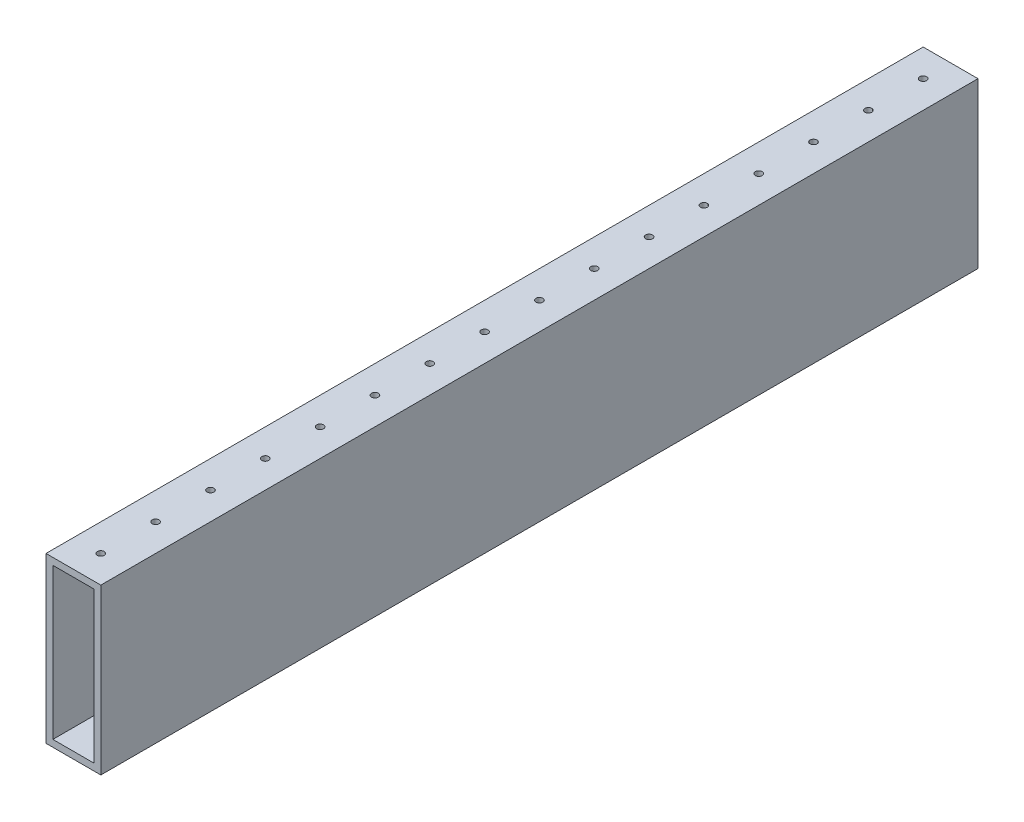
ISO-10303-21;
HEADER;
FILE_DESCRIPTION(('STEP AP214'),'2;1');
FILE_NAME('part.step','',(''),(''),'','','');
FILE_SCHEMA(('AUTOMOTIVE_DESIGN { 1 0 10303 214 1 1 1 1 }'));
ENDSEC;
DATA;
#1=APPLICATION_CONTEXT('core data for automotive mechanical design processes');
#2=APPLICATION_PROTOCOL_DEFINITION('international standard','automotive_design',2000,#1);
#3=PRODUCT_CONTEXT('',#1,'mechanical');
#4=PRODUCT('Part','Part','',(#3));
#5=PRODUCT_RELATED_PRODUCT_CATEGORY('part','',(#4));
#6=PRODUCT_DEFINITION_FORMATION('','',#4);
#7=PRODUCT_DEFINITION_CONTEXT('part definition',#1,'design');
#8=PRODUCT_DEFINITION('design','',#6,#7);
#9=PRODUCT_DEFINITION_SHAPE('','',#8);
#10=(LENGTH_UNIT() NAMED_UNIT(*) SI_UNIT(.MILLI.,.METRE.));
#11=(NAMED_UNIT(*) PLANE_ANGLE_UNIT() SI_UNIT($,.RADIAN.));
#12=(NAMED_UNIT(*) SI_UNIT($,.STERADIAN.) SOLID_ANGLE_UNIT());
#13=UNCERTAINTY_MEASURE_WITH_UNIT(LENGTH_MEASURE(1.E-05),#10,'distance_accuracy_value','');
#14=(GEOMETRIC_REPRESENTATION_CONTEXT(3) GLOBAL_UNCERTAINTY_ASSIGNED_CONTEXT((#13)) GLOBAL_UNIT_ASSIGNED_CONTEXT((#10,
#11,#12)) REPRESENTATION_CONTEXT('',''));
#15=CARTESIAN_POINT('',(0.,0.,0.));
#16=DIRECTION('',(0.,0.,1.));
#17=DIRECTION('',(1.,0.,0.));
#18=AXIS2_PLACEMENT_3D('',#15,#16,#17);
#19=CARTESIAN_POINT('',(0.,0.,406.4));
#20=DIRECTION('',(0.,0.,-1.));
#21=DIRECTION('',(-1.,0.,0.));
#22=AXIS2_PLACEMENT_3D('',#19,#20,#21);
#23=PLANE('',#22);
#24=DIRECTION('',(0.,1.,0.));
#25=VECTOR('',#24,1.);
#26=CARTESIAN_POINT('',(12.7,-38.1,406.4));
#27=LINE('',#26,#25);
#28=CARTESIAN_POINT('',(12.7,-38.1,406.4));
#29=VERTEX_POINT('',#28);
#30=CARTESIAN_POINT('',(12.7,38.1,406.4));
#31=VERTEX_POINT('',#30);
#32=EDGE_CURVE('E131',#29,#31,#27,.T.);
#33=ORIENTED_EDGE('',*,*,#32,.T.);
#34=DIRECTION('',(-1.,0.,0.));
#35=VECTOR('',#34,1.);
#36=CARTESIAN_POINT('',(-12.7,38.1,406.4));
#37=LINE('',#36,#35);
#38=CARTESIAN_POINT('',(-12.7,38.1,406.4));
#39=VERTEX_POINT('',#38);
#40=EDGE_CURVE('E134',#31,#39,#37,.T.);
#41=ORIENTED_EDGE('',*,*,#40,.T.);
#42=DIRECTION('',(0.,-1.,0.));
#43=VECTOR('',#42,1.);
#44=CARTESIAN_POINT('',(-12.7,-38.1,406.4));
#45=LINE('',#44,#43);
#46=CARTESIAN_POINT('',(-12.7,-38.1,406.4));
#47=VERTEX_POINT('',#46);
#48=EDGE_CURVE('E137',#39,#47,#45,.T.);
#49=ORIENTED_EDGE('',*,*,#48,.T.);
#50=DIRECTION('',(1.,0.,0.));
#51=VECTOR('',#50,1.);
#52=CARTESIAN_POINT('',(-12.7,-38.1,406.4));
#53=LINE('',#52,#51);
#54=EDGE_CURVE('E139',#47,#29,#53,.T.);
#55=ORIENTED_EDGE('',*,*,#54,.T.);
#56=EDGE_LOOP('',(#33,#41,#49,#55));
#57=FACE_BOUND('',#56,.T.);
#58=DIRECTION('',(0.,1.,0.));
#59=VECTOR('',#58,1.);
#60=CARTESIAN_POINT('',(9.525,0.,406.4));
#61=LINE('',#60,#59);
#62=CARTESIAN_POINT('',(9.525,-34.925,406.4));
#63=VERTEX_POINT('',#62);
#64=CARTESIAN_POINT('',(9.525,34.925,406.4));
#65=VERTEX_POINT('',#64);
#66=EDGE_CURVE('E119',#63,#65,#61,.T.);
#67=ORIENTED_EDGE('',*,*,#66,.F.);
#68=DIRECTION('',(1.,0.,0.));
#69=VECTOR('',#68,1.);
#70=CARTESIAN_POINT('',(0.,-34.925,406.4));
#71=LINE('',#70,#69);
#72=CARTESIAN_POINT('',(-9.525,-34.925,406.4));
#73=VERTEX_POINT('',#72);
#74=EDGE_CURVE('E103',#73,#63,#71,.T.);
#75=ORIENTED_EDGE('',*,*,#74,.F.);
#76=DIRECTION('',(0.,-1.,0.));
#77=VECTOR('',#76,1.);
#78=CARTESIAN_POINT('',(-9.525,0.,406.4));
#79=LINE('',#78,#77);
#80=CARTESIAN_POINT('',(-9.525,34.925,406.4));
#81=VERTEX_POINT('',#80);
#82=EDGE_CURVE('E128',#81,#73,#79,.T.);
#83=ORIENTED_EDGE('',*,*,#82,.F.);
#84=DIRECTION('',(-1.,0.,0.));
#85=VECTOR('',#84,1.);
#86=CARTESIAN_POINT('',(0.,34.925,406.4));
#87=LINE('',#86,#85);
#88=EDGE_CURVE('E121',#65,#81,#87,.T.);
#89=ORIENTED_EDGE('',*,*,#88,.F.);
#90=EDGE_LOOP('',(#67,#75,#83,#89));
#91=FACE_BOUND('',#90,.T.);
#92=ADVANCED_FACE('F33',(#57,#91),#23,.F.);
#93=CARTESIAN_POINT('',(0.,0.,0.));
#94=DIRECTION('',(0.,0.,-1.));
#95=DIRECTION('',(-1.,0.,0.));
#96=AXIS2_PLACEMENT_3D('',#93,#94,#95);
#97=PLANE('',#96);
#98=DIRECTION('',(0.,1.,0.));
#99=VECTOR('',#98,1.);
#100=CARTESIAN_POINT('',(12.7,-38.1,0.));
#101=LINE('',#100,#99);
#102=CARTESIAN_POINT('',(12.7,-38.1,0.));
#103=VERTEX_POINT('',#102);
#104=CARTESIAN_POINT('',(12.7,38.1,0.));
#105=VERTEX_POINT('',#104);
#106=EDGE_CURVE('E142',#103,#105,#101,.T.);
#107=ORIENTED_EDGE('',*,*,#106,.F.);
#108=DIRECTION('',(1.,0.,0.));
#109=VECTOR('',#108,1.);
#110=CARTESIAN_POINT('',(-12.7,-38.1,0.));
#111=LINE('',#110,#109);
#112=CARTESIAN_POINT('',(-12.7,-38.1,0.));
#113=VERTEX_POINT('',#112);
#114=EDGE_CURVE('E135',#113,#103,#111,.T.);
#115=ORIENTED_EDGE('',*,*,#114,.F.);
#116=DIRECTION('',(0.,-1.,0.));
#117=VECTOR('',#116,1.);
#118=CARTESIAN_POINT('',(-12.7,-38.1,0.));
#119=LINE('',#118,#117);
#120=CARTESIAN_POINT('',(-12.7,38.1,0.));
#121=VERTEX_POINT('',#120);
#122=EDGE_CURVE('E147',#121,#113,#119,.T.);
#123=ORIENTED_EDGE('',*,*,#122,.F.);
#124=DIRECTION('',(-1.,0.,0.));
#125=VECTOR('',#124,1.);
#126=CARTESIAN_POINT('',(-12.7,38.1,0.));
#127=LINE('',#126,#125);
#128=EDGE_CURVE('E145',#105,#121,#127,.T.);
#129=ORIENTED_EDGE('',*,*,#128,.F.);
#130=EDGE_LOOP('',(#107,#115,#123,#129));
#131=FACE_BOUND('',#130,.T.);
#132=DIRECTION('',(1.,0.,0.));
#133=VECTOR('',#132,1.);
#134=CARTESIAN_POINT('',(0.,-34.925,0.));
#135=LINE('',#134,#133);
#136=CARTESIAN_POINT('',(-9.525,-34.925,0.));
#137=VERTEX_POINT('',#136);
#138=CARTESIAN_POINT('',(9.525,-34.925,0.));
#139=VERTEX_POINT('',#138);
#140=EDGE_CURVE('E101',#137,#139,#135,.T.);
#141=ORIENTED_EDGE('',*,*,#140,.T.);
#142=DIRECTION('',(0.,1.,0.));
#143=VECTOR('',#142,1.);
#144=CARTESIAN_POINT('',(9.525,0.,0.));
#145=LINE('',#144,#143);
#146=CARTESIAN_POINT('',(9.525,34.925,0.));
#147=VERTEX_POINT('',#146);
#148=EDGE_CURVE('E109',#139,#147,#145,.T.);
#149=ORIENTED_EDGE('',*,*,#148,.T.);
#150=DIRECTION('',(-1.,0.,0.));
#151=VECTOR('',#150,1.);
#152=CARTESIAN_POINT('',(0.,34.925,0.));
#153=LINE('',#152,#151);
#154=CARTESIAN_POINT('',(-9.525,34.925,0.));
#155=VERTEX_POINT('',#154);
#156=EDGE_CURVE('E115',#147,#155,#153,.T.);
#157=ORIENTED_EDGE('',*,*,#156,.T.);
#158=DIRECTION('',(0.,-1.,0.));
#159=VECTOR('',#158,1.);
#160=CARTESIAN_POINT('',(-9.525,0.,0.));
#161=LINE('',#160,#159);
#162=EDGE_CURVE('E55',#155,#137,#161,.T.);
#163=ORIENTED_EDGE('',*,*,#162,.T.);
#164=EDGE_LOOP('',(#141,#149,#157,#163));
#165=FACE_BOUND('',#164,.T.);
#166=ADVANCED_FACE('F118',(#131,#165),#97,.T.);
#167=CARTESIAN_POINT('',(12.7,-38.1,406.4));
#168=DIRECTION('',(-1.,0.,0.));
#169=DIRECTION('',(0.,0.,1.));
#170=AXIS2_PLACEMENT_3D('',#167,#168,#169);
#171=PLANE('',#170);
#172=ORIENTED_EDGE('',*,*,#106,.T.);
#173=DIRECTION('',(0.,0.,-1.));
#174=VECTOR('',#173,1.);
#175=CARTESIAN_POINT('',(12.7,38.1,406.4));
#176=LINE('',#175,#174);
#177=EDGE_CURVE('E158',#31,#105,#176,.T.);
#178=ORIENTED_EDGE('',*,*,#177,.F.);
#179=ORIENTED_EDGE('',*,*,#32,.F.);
#180=DIRECTION('',(0.,0.,-1.));
#181=VECTOR('',#180,1.);
#182=CARTESIAN_POINT('',(12.7,-38.1,406.4));
#183=LINE('',#182,#181);
#184=EDGE_CURVE('E141',#29,#103,#183,.T.);
#185=ORIENTED_EDGE('',*,*,#184,.T.);
#186=EDGE_LOOP('',(#172,#178,#179,#185));
#187=FACE_BOUND('',#186,.T.);
#188=ADVANCED_FACE('F251',(#187),#171,.F.);
#189=CARTESIAN_POINT('',(-12.7,38.1,406.4));
#190=DIRECTION('',(0.,-1.,0.));
#191=DIRECTION('',(0.,0.,-1.));
#192=AXIS2_PLACEMENT_3D('',#189,#190,#191);
#193=PLANE('',#192);
#194=CARTESIAN_POINT('',(0.,38.1,38.1));
#195=DIRECTION('',(0.,1.,0.));
#196=DIRECTION('',(0.,0.,1.));
#197=AXIS2_PLACEMENT_3D('',#194,#195,#196);
#198=CIRCLE('',#197,1.5875);
#199=CARTESIAN_POINT('',(0.,38.1,39.6875));
#200=VERTEX_POINT('',#199);
#201=EDGE_CURVE('E439',#200,#200,#198,.T.);
#202=ORIENTED_EDGE('',*,*,#201,.F.);
#203=EDGE_LOOP('',(#202));
#204=FACE_BOUND('',#203,.T.);
#205=CARTESIAN_POINT('',(0.,38.1,12.7));
#206=DIRECTION('',(0.,1.,0.));
#207=DIRECTION('',(0.,0.,1.));
#208=AXIS2_PLACEMENT_3D('',#205,#206,#207);
#209=CIRCLE('',#208,1.5875);
#210=CARTESIAN_POINT('',(0.,38.1,14.2875));
#211=VERTEX_POINT('',#210);
#212=EDGE_CURVE('E438',#211,#211,#209,.T.);
#213=ORIENTED_EDGE('',*,*,#212,.F.);
#214=EDGE_LOOP('',(#213));
#215=FACE_BOUND('',#214,.T.);
#216=ORIENTED_EDGE('',*,*,#128,.T.);
#217=DIRECTION('',(0.,0.,-1.));
#218=VECTOR('',#217,1.);
#219=CARTESIAN_POINT('',(-12.7,38.1,406.4));
#220=LINE('',#219,#218);
#221=EDGE_CURVE('E155',#39,#121,#220,.T.);
#222=ORIENTED_EDGE('',*,*,#221,.F.);
#223=ORIENTED_EDGE('',*,*,#40,.F.);
#224=ORIENTED_EDGE('',*,*,#177,.T.);
#225=EDGE_LOOP('',(#216,#222,#223,#224));
#226=FACE_BOUND('',#225,.T.);
#227=CARTESIAN_POINT('',(0.,38.1,63.5));
#228=DIRECTION('',(0.,1.,0.));
#229=DIRECTION('',(0.,0.,1.));
#230=AXIS2_PLACEMENT_3D('',#227,#228,#229);
#231=CIRCLE('',#230,1.5875);
#232=CARTESIAN_POINT('',(0.,38.1,65.0875));
#233=VERTEX_POINT('',#232);
#234=EDGE_CURVE('E164',#233,#233,#231,.T.);
#235=ORIENTED_EDGE('',*,*,#234,.F.);
#236=EDGE_LOOP('',(#235));
#237=FACE_BOUND('',#236,.T.);
#238=CARTESIAN_POINT('',(0.,38.1,88.9));
#239=DIRECTION('',(0.,1.,0.));
#240=DIRECTION('',(0.,0.,1.));
#241=AXIS2_PLACEMENT_3D('',#238,#239,#240);
#242=CIRCLE('',#241,1.5875);
#243=CARTESIAN_POINT('',(0.,38.1,90.4875));
#244=VERTEX_POINT('',#243);
#245=EDGE_CURVE('E170',#244,#244,#242,.T.);
#246=ORIENTED_EDGE('',*,*,#245,.F.);
#247=EDGE_LOOP('',(#246));
#248=FACE_BOUND('',#247,.T.);
#249=CARTESIAN_POINT('',(0.,38.1,114.3));
#250=DIRECTION('',(0.,1.,0.));
#251=DIRECTION('',(0.,0.,1.));
#252=AXIS2_PLACEMENT_3D('',#249,#250,#251);
#253=CIRCLE('',#252,1.5875);
#254=CARTESIAN_POINT('',(0.,38.1,115.8875));
#255=VERTEX_POINT('',#254);
#256=EDGE_CURVE('E176',#255,#255,#253,.T.);
#257=ORIENTED_EDGE('',*,*,#256,.F.);
#258=EDGE_LOOP('',(#257));
#259=FACE_BOUND('',#258,.T.);
#260=CARTESIAN_POINT('',(0.,38.1,139.7));
#261=DIRECTION('',(0.,1.,0.));
#262=DIRECTION('',(0.,0.,1.));
#263=AXIS2_PLACEMENT_3D('',#260,#261,#262);
#264=CIRCLE('',#263,1.5875);
#265=CARTESIAN_POINT('',(0.,38.1,141.2875));
#266=VERTEX_POINT('',#265);
#267=EDGE_CURVE('E182',#266,#266,#264,.T.);
#268=ORIENTED_EDGE('',*,*,#267,.F.);
#269=EDGE_LOOP('',(#268));
#270=FACE_BOUND('',#269,.T.);
#271=CARTESIAN_POINT('',(0.,38.1,165.1));
#272=DIRECTION('',(0.,1.,0.));
#273=DIRECTION('',(0.,0.,1.));
#274=AXIS2_PLACEMENT_3D('',#271,#272,#273);
#275=CIRCLE('',#274,1.5875);
#276=CARTESIAN_POINT('',(0.,38.1,166.6875));
#277=VERTEX_POINT('',#276);
#278=EDGE_CURVE('E188',#277,#277,#275,.T.);
#279=ORIENTED_EDGE('',*,*,#278,.F.);
#280=EDGE_LOOP('',(#279));
#281=FACE_BOUND('',#280,.T.);
#282=CARTESIAN_POINT('',(0.,38.1,190.5));
#283=DIRECTION('',(0.,1.,0.));
#284=DIRECTION('',(0.,0.,1.));
#285=AXIS2_PLACEMENT_3D('',#282,#283,#284);
#286=CIRCLE('',#285,1.5875);
#287=CARTESIAN_POINT('',(0.,38.1,192.0875));
#288=VERTEX_POINT('',#287);
#289=EDGE_CURVE('E194',#288,#288,#286,.T.);
#290=ORIENTED_EDGE('',*,*,#289,.F.);
#291=EDGE_LOOP('',(#290));
#292=FACE_BOUND('',#291,.T.);
#293=CARTESIAN_POINT('',(0.,38.1,215.9));
#294=DIRECTION('',(0.,1.,0.));
#295=DIRECTION('',(0.,0.,1.));
#296=AXIS2_PLACEMENT_3D('',#293,#294,#295);
#297=CIRCLE('',#296,1.5875);
#298=CARTESIAN_POINT('',(0.,38.1,217.4875));
#299=VERTEX_POINT('',#298);
#300=EDGE_CURVE('E200',#299,#299,#297,.T.);
#301=ORIENTED_EDGE('',*,*,#300,.F.);
#302=EDGE_LOOP('',(#301));
#303=FACE_BOUND('',#302,.T.);
#304=CARTESIAN_POINT('',(0.,38.1,241.3));
#305=DIRECTION('',(0.,1.,0.));
#306=DIRECTION('',(0.,0.,1.));
#307=AXIS2_PLACEMENT_3D('',#304,#305,#306);
#308=CIRCLE('',#307,1.5875);
#309=CARTESIAN_POINT('',(0.,38.1,242.8875));
#310=VERTEX_POINT('',#309);
#311=EDGE_CURVE('E206',#310,#310,#308,.T.);
#312=ORIENTED_EDGE('',*,*,#311,.F.);
#313=EDGE_LOOP('',(#312));
#314=FACE_BOUND('',#313,.T.);
#315=CARTESIAN_POINT('',(0.,38.1,266.7));
#316=DIRECTION('',(0.,1.,0.));
#317=DIRECTION('',(0.,0.,1.));
#318=AXIS2_PLACEMENT_3D('',#315,#316,#317);
#319=CIRCLE('',#318,1.5875);
#320=CARTESIAN_POINT('',(0.,38.1,268.2875));
#321=VERTEX_POINT('',#320);
#322=EDGE_CURVE('E212',#321,#321,#319,.T.);
#323=ORIENTED_EDGE('',*,*,#322,.F.);
#324=EDGE_LOOP('',(#323));
#325=FACE_BOUND('',#324,.T.);
#326=CARTESIAN_POINT('',(0.,38.1,292.1));
#327=DIRECTION('',(0.,1.,0.));
#328=DIRECTION('',(0.,0.,1.));
#329=AXIS2_PLACEMENT_3D('',#326,#327,#328);
#330=CIRCLE('',#329,1.5875);
#331=CARTESIAN_POINT('',(0.,38.1,293.6875));
#332=VERTEX_POINT('',#331);
#333=EDGE_CURVE('E218',#332,#332,#330,.T.);
#334=ORIENTED_EDGE('',*,*,#333,.F.);
#335=EDGE_LOOP('',(#334));
#336=FACE_BOUND('',#335,.T.);
#337=CARTESIAN_POINT('',(0.,38.1,317.5));
#338=DIRECTION('',(0.,1.,0.));
#339=DIRECTION('',(0.,0.,1.));
#340=AXIS2_PLACEMENT_3D('',#337,#338,#339);
#341=CIRCLE('',#340,1.5875);
#342=CARTESIAN_POINT('',(0.,38.1,319.0875));
#343=VERTEX_POINT('',#342);
#344=EDGE_CURVE('E224',#343,#343,#341,.T.);
#345=ORIENTED_EDGE('',*,*,#344,.F.);
#346=EDGE_LOOP('',(#345));
#347=FACE_BOUND('',#346,.T.);
#348=CARTESIAN_POINT('',(0.,38.1,342.9));
#349=DIRECTION('',(0.,1.,0.));
#350=DIRECTION('',(0.,0.,1.));
#351=AXIS2_PLACEMENT_3D('',#348,#349,#350);
#352=CIRCLE('',#351,1.5875);
#353=CARTESIAN_POINT('',(0.,38.1,344.4875));
#354=VERTEX_POINT('',#353);
#355=EDGE_CURVE('E230',#354,#354,#352,.T.);
#356=ORIENTED_EDGE('',*,*,#355,.F.);
#357=EDGE_LOOP('',(#356));
#358=FACE_BOUND('',#357,.T.);
#359=CARTESIAN_POINT('',(0.,38.1,368.3));
#360=DIRECTION('',(0.,1.,0.));
#361=DIRECTION('',(0.,0.,1.));
#362=AXIS2_PLACEMENT_3D('',#359,#360,#361);
#363=CIRCLE('',#362,1.5875);
#364=CARTESIAN_POINT('',(0.,38.1,369.8875));
#365=VERTEX_POINT('',#364);
#366=EDGE_CURVE('E236',#365,#365,#363,.T.);
#367=ORIENTED_EDGE('',*,*,#366,.F.);
#368=EDGE_LOOP('',(#367));
#369=FACE_BOUND('',#368,.T.);
#370=CARTESIAN_POINT('',(0.,38.1,393.7));
#371=DIRECTION('',(0.,1.,0.));
#372=DIRECTION('',(0.,0.,1.));
#373=AXIS2_PLACEMENT_3D('',#370,#371,#372);
#374=CIRCLE('',#373,1.5875);
#375=CARTESIAN_POINT('',(0.,38.1,395.2875));
#376=VERTEX_POINT('',#375);
#377=EDGE_CURVE('E11',#376,#376,#374,.T.);
#378=ORIENTED_EDGE('',*,*,#377,.F.);
#379=EDGE_LOOP('',(#378));
#380=FACE_BOUND('',#379,.T.);
#381=ADVANCED_FACE('F248',(#204,#215,#226,#237,#248,#259,#270,#281,#292,#303,#314,#325,#336,
#347,#358,#369,#380),#193,.F.);
#382=CARTESIAN_POINT('',(-12.7,-38.1,406.4));
#383=DIRECTION('',(1.,0.,0.));
#384=DIRECTION('',(0.,0.,-1.));
#385=AXIS2_PLACEMENT_3D('',#382,#383,#384);
#386=PLANE('',#385);
#387=ORIENTED_EDGE('',*,*,#122,.T.);
#388=DIRECTION('',(0.,0.,-1.));
#389=VECTOR('',#388,1.);
#390=CARTESIAN_POINT('',(-12.7,-38.1,406.4));
#391=LINE('',#390,#389);
#392=EDGE_CURVE('E152',#47,#113,#391,.T.);
#393=ORIENTED_EDGE('',*,*,#392,.F.);
#394=ORIENTED_EDGE('',*,*,#48,.F.);
#395=ORIENTED_EDGE('',*,*,#221,.T.);
#396=EDGE_LOOP('',(#387,#393,#394,#395));
#397=FACE_BOUND('',#396,.T.);
#398=ADVANCED_FACE('F250',(#397),#386,.F.);
#399=CARTESIAN_POINT('',(-12.7,-38.1,406.4));
#400=DIRECTION('',(0.,1.,0.));
#401=DIRECTION('',(0.,0.,1.));
#402=AXIS2_PLACEMENT_3D('',#399,#400,#401);
#403=PLANE('',#402);
#404=ORIENTED_EDGE('',*,*,#114,.T.);
#405=ORIENTED_EDGE('',*,*,#184,.F.);
#406=ORIENTED_EDGE('',*,*,#54,.F.);
#407=ORIENTED_EDGE('',*,*,#392,.T.);
#408=EDGE_LOOP('',(#404,#405,#406,#407));
#409=FACE_BOUND('',#408,.T.);
#410=ADVANCED_FACE('F258',(#409),#403,.F.);
#411=CARTESIAN_POINT('',(9.525,-38.1,406.4));
#412=DIRECTION('',(-1.,0.,0.));
#413=DIRECTION('',(0.,0.,1.));
#414=AXIS2_PLACEMENT_3D('',#411,#412,#413);
#415=PLANE('',#414);
#416=ORIENTED_EDGE('',*,*,#148,.F.);
#417=DIRECTION('',(0.,0.,-1.));
#418=VECTOR('',#417,1.);
#419=CARTESIAN_POINT('',(9.525,-34.925,406.4));
#420=LINE('',#419,#418);
#421=EDGE_CURVE('E97',#63,#139,#420,.T.);
#422=ORIENTED_EDGE('',*,*,#421,.F.);
#423=ORIENTED_EDGE('',*,*,#66,.T.);
#424=DIRECTION('',(0.,0.,-1.));
#425=VECTOR('',#424,1.);
#426=CARTESIAN_POINT('',(9.525,34.925,406.4));
#427=LINE('',#426,#425);
#428=EDGE_CURVE('E112',#65,#147,#427,.T.);
#429=ORIENTED_EDGE('',*,*,#428,.T.);
#430=EDGE_LOOP('',(#416,#422,#423,#429));
#431=FACE_BOUND('',#430,.T.);
#432=ADVANCED_FACE('F110',(#431),#415,.T.);
#433=CARTESIAN_POINT('',(-12.7,34.925,406.4));
#434=DIRECTION('',(0.,-1.,0.));
#435=DIRECTION('',(0.,0.,-1.));
#436=AXIS2_PLACEMENT_3D('',#433,#434,#435);
#437=PLANE('',#436);
#438=CARTESIAN_POINT('',(0.,34.925,38.1));
#439=DIRECTION('',(0.,1.,0.));
#440=DIRECTION('',(0.,0.,1.));
#441=AXIS2_PLACEMENT_3D('',#438,#439,#440);
#442=CIRCLE('',#441,1.5875);
#443=CARTESIAN_POINT('',(0.,34.925,39.6875));
#444=VERTEX_POINT('',#443);
#445=EDGE_CURVE('E443',#444,#444,#442,.T.);
#446=ORIENTED_EDGE('',*,*,#445,.T.);
#447=EDGE_LOOP('',(#446));
#448=FACE_BOUND('',#447,.T.);
#449=CARTESIAN_POINT('',(0.,34.925,12.7));
#450=DIRECTION('',(0.,1.,0.));
#451=DIRECTION('',(0.,0.,1.));
#452=AXIS2_PLACEMENT_3D('',#449,#450,#451);
#453=CIRCLE('',#452,1.5875);
#454=CARTESIAN_POINT('',(0.,34.925,14.2875));
#455=VERTEX_POINT('',#454);
#456=EDGE_CURVE('E116',#455,#455,#453,.T.);
#457=ORIENTED_EDGE('',*,*,#456,.T.);
#458=EDGE_LOOP('',(#457));
#459=FACE_BOUND('',#458,.T.);
#460=ORIENTED_EDGE('',*,*,#156,.F.);
#461=ORIENTED_EDGE('',*,*,#428,.F.);
#462=ORIENTED_EDGE('',*,*,#88,.T.);
#463=DIRECTION('',(0.,0.,-1.));
#464=VECTOR('',#463,1.);
#465=CARTESIAN_POINT('',(-9.525,34.925,406.4));
#466=LINE('',#465,#464);
#467=EDGE_CURVE('E446',#81,#155,#466,.T.);
#468=ORIENTED_EDGE('',*,*,#467,.T.);
#469=EDGE_LOOP('',(#460,#461,#462,#468));
#470=FACE_BOUND('',#469,.T.);
#471=CARTESIAN_POINT('',(0.,34.925,63.5));
#472=DIRECTION('',(0.,1.,0.));
#473=DIRECTION('',(0.,0.,1.));
#474=AXIS2_PLACEMENT_3D('',#471,#472,#473);
#475=CIRCLE('',#474,1.5875);
#476=CARTESIAN_POINT('',(0.,34.925,65.0875));
#477=VERTEX_POINT('',#476);
#478=EDGE_CURVE('E161',#477,#477,#475,.T.);
#479=ORIENTED_EDGE('',*,*,#478,.T.);
#480=EDGE_LOOP('',(#479));
#481=FACE_BOUND('',#480,.T.);
#482=CARTESIAN_POINT('',(0.,34.925,88.9));
#483=DIRECTION('',(0.,1.,0.));
#484=DIRECTION('',(0.,0.,1.));
#485=AXIS2_PLACEMENT_3D('',#482,#483,#484);
#486=CIRCLE('',#485,1.5875);
#487=CARTESIAN_POINT('',(0.,34.925,90.4875));
#488=VERTEX_POINT('',#487);
#489=EDGE_CURVE('E167',#488,#488,#486,.T.);
#490=ORIENTED_EDGE('',*,*,#489,.T.);
#491=EDGE_LOOP('',(#490));
#492=FACE_BOUND('',#491,.T.);
#493=CARTESIAN_POINT('',(0.,34.925,114.3));
#494=DIRECTION('',(0.,1.,0.));
#495=DIRECTION('',(0.,0.,1.));
#496=AXIS2_PLACEMENT_3D('',#493,#494,#495);
#497=CIRCLE('',#496,1.5875);
#498=CARTESIAN_POINT('',(0.,34.925,115.8875));
#499=VERTEX_POINT('',#498);
#500=EDGE_CURVE('E173',#499,#499,#497,.T.);
#501=ORIENTED_EDGE('',*,*,#500,.T.);
#502=EDGE_LOOP('',(#501));
#503=FACE_BOUND('',#502,.T.);
#504=CARTESIAN_POINT('',(0.,34.925,139.7));
#505=DIRECTION('',(0.,1.,0.));
#506=DIRECTION('',(0.,0.,1.));
#507=AXIS2_PLACEMENT_3D('',#504,#505,#506);
#508=CIRCLE('',#507,1.5875);
#509=CARTESIAN_POINT('',(0.,34.925,141.2875));
#510=VERTEX_POINT('',#509);
#511=EDGE_CURVE('E179',#510,#510,#508,.T.);
#512=ORIENTED_EDGE('',*,*,#511,.T.);
#513=EDGE_LOOP('',(#512));
#514=FACE_BOUND('',#513,.T.);
#515=CARTESIAN_POINT('',(0.,34.925,165.1));
#516=DIRECTION('',(0.,1.,0.));
#517=DIRECTION('',(0.,0.,1.));
#518=AXIS2_PLACEMENT_3D('',#515,#516,#517);
#519=CIRCLE('',#518,1.5875);
#520=CARTESIAN_POINT('',(0.,34.925,166.6875));
#521=VERTEX_POINT('',#520);
#522=EDGE_CURVE('E185',#521,#521,#519,.T.);
#523=ORIENTED_EDGE('',*,*,#522,.T.);
#524=EDGE_LOOP('',(#523));
#525=FACE_BOUND('',#524,.T.);
#526=CARTESIAN_POINT('',(0.,34.925,190.5));
#527=DIRECTION('',(0.,1.,0.));
#528=DIRECTION('',(0.,0.,1.));
#529=AXIS2_PLACEMENT_3D('',#526,#527,#528);
#530=CIRCLE('',#529,1.5875);
#531=CARTESIAN_POINT('',(0.,34.925,192.0875));
#532=VERTEX_POINT('',#531);
#533=EDGE_CURVE('E191',#532,#532,#530,.T.);
#534=ORIENTED_EDGE('',*,*,#533,.T.);
#535=EDGE_LOOP('',(#534));
#536=FACE_BOUND('',#535,.T.);
#537=CARTESIAN_POINT('',(0.,34.925,215.9));
#538=DIRECTION('',(0.,1.,0.));
#539=DIRECTION('',(0.,0.,1.));
#540=AXIS2_PLACEMENT_3D('',#537,#538,#539);
#541=CIRCLE('',#540,1.5875);
#542=CARTESIAN_POINT('',(0.,34.925,217.4875));
#543=VERTEX_POINT('',#542);
#544=EDGE_CURVE('E197',#543,#543,#541,.T.);
#545=ORIENTED_EDGE('',*,*,#544,.T.);
#546=EDGE_LOOP('',(#545));
#547=FACE_BOUND('',#546,.T.);
#548=CARTESIAN_POINT('',(0.,34.925,241.3));
#549=DIRECTION('',(0.,1.,0.));
#550=DIRECTION('',(0.,0.,1.));
#551=AXIS2_PLACEMENT_3D('',#548,#549,#550);
#552=CIRCLE('',#551,1.5875);
#553=CARTESIAN_POINT('',(0.,34.925,242.8875));
#554=VERTEX_POINT('',#553);
#555=EDGE_CURVE('E203',#554,#554,#552,.T.);
#556=ORIENTED_EDGE('',*,*,#555,.T.);
#557=EDGE_LOOP('',(#556));
#558=FACE_BOUND('',#557,.T.);
#559=CARTESIAN_POINT('',(0.,34.925,266.7));
#560=DIRECTION('',(0.,1.,0.));
#561=DIRECTION('',(0.,0.,1.));
#562=AXIS2_PLACEMENT_3D('',#559,#560,#561);
#563=CIRCLE('',#562,1.5875);
#564=CARTESIAN_POINT('',(0.,34.925,268.2875));
#565=VERTEX_POINT('',#564);
#566=EDGE_CURVE('E209',#565,#565,#563,.T.);
#567=ORIENTED_EDGE('',*,*,#566,.T.);
#568=EDGE_LOOP('',(#567));
#569=FACE_BOUND('',#568,.T.);
#570=CARTESIAN_POINT('',(0.,34.925,292.1));
#571=DIRECTION('',(0.,1.,0.));
#572=DIRECTION('',(0.,0.,1.));
#573=AXIS2_PLACEMENT_3D('',#570,#571,#572);
#574=CIRCLE('',#573,1.5875);
#575=CARTESIAN_POINT('',(0.,34.925,293.6875));
#576=VERTEX_POINT('',#575);
#577=EDGE_CURVE('E215',#576,#576,#574,.T.);
#578=ORIENTED_EDGE('',*,*,#577,.T.);
#579=EDGE_LOOP('',(#578));
#580=FACE_BOUND('',#579,.T.);
#581=CARTESIAN_POINT('',(0.,34.925,317.5));
#582=DIRECTION('',(0.,1.,0.));
#583=DIRECTION('',(0.,0.,1.));
#584=AXIS2_PLACEMENT_3D('',#581,#582,#583);
#585=CIRCLE('',#584,1.5875);
#586=CARTESIAN_POINT('',(0.,34.925,319.0875));
#587=VERTEX_POINT('',#586);
#588=EDGE_CURVE('E221',#587,#587,#585,.T.);
#589=ORIENTED_EDGE('',*,*,#588,.T.);
#590=EDGE_LOOP('',(#589));
#591=FACE_BOUND('',#590,.T.);
#592=CARTESIAN_POINT('',(0.,34.925,342.9));
#593=DIRECTION('',(0.,1.,0.));
#594=DIRECTION('',(0.,0.,1.));
#595=AXIS2_PLACEMENT_3D('',#592,#593,#594);
#596=CIRCLE('',#595,1.5875);
#597=CARTESIAN_POINT('',(0.,34.925,344.4875));
#598=VERTEX_POINT('',#597);
#599=EDGE_CURVE('E227',#598,#598,#596,.T.);
#600=ORIENTED_EDGE('',*,*,#599,.T.);
#601=EDGE_LOOP('',(#600));
#602=FACE_BOUND('',#601,.T.);
#603=CARTESIAN_POINT('',(0.,34.925,368.3));
#604=DIRECTION('',(0.,1.,0.));
#605=DIRECTION('',(0.,0.,1.));
#606=AXIS2_PLACEMENT_3D('',#603,#604,#605);
#607=CIRCLE('',#606,1.5875);
#608=CARTESIAN_POINT('',(0.,34.925,369.8875));
#609=VERTEX_POINT('',#608);
#610=EDGE_CURVE('E233',#609,#609,#607,.T.);
#611=ORIENTED_EDGE('',*,*,#610,.T.);
#612=EDGE_LOOP('',(#611));
#613=FACE_BOUND('',#612,.T.);
#614=CARTESIAN_POINT('',(0.,34.925,393.7));
#615=DIRECTION('',(0.,1.,0.));
#616=DIRECTION('',(0.,0.,1.));
#617=AXIS2_PLACEMENT_3D('',#614,#615,#616);
#618=CIRCLE('',#617,1.5875);
#619=CARTESIAN_POINT('',(0.,34.925,395.2875));
#620=VERTEX_POINT('',#619);
#621=EDGE_CURVE('E41',#620,#620,#618,.T.);
#622=ORIENTED_EDGE('',*,*,#621,.T.);
#623=EDGE_LOOP('',(#622));
#624=FACE_BOUND('',#623,.T.);
#625=ADVANCED_FACE('F241',(#448,#459,#470,#481,#492,#503,#514,#525,#536,#547,#558,#569,#580,
#591,#602,#613,#624),#437,.T.);
#626=CARTESIAN_POINT('',(-9.525,-38.1,406.4));
#627=DIRECTION('',(1.,0.,0.));
#628=DIRECTION('',(0.,0.,-1.));
#629=AXIS2_PLACEMENT_3D('',#626,#627,#628);
#630=PLANE('',#629);
#631=ORIENTED_EDGE('',*,*,#162,.F.);
#632=ORIENTED_EDGE('',*,*,#467,.F.);
#633=ORIENTED_EDGE('',*,*,#82,.T.);
#634=DIRECTION('',(0.,0.,-1.));
#635=VECTOR('',#634,1.);
#636=CARTESIAN_POINT('',(-9.525,-34.925,406.4));
#637=LINE('',#636,#635);
#638=EDGE_CURVE('E48',#73,#137,#637,.T.);
#639=ORIENTED_EDGE('',*,*,#638,.T.);
#640=EDGE_LOOP('',(#631,#632,#633,#639));
#641=FACE_BOUND('',#640,.T.);
#642=ADVANCED_FACE('F386',(#641),#630,.T.);
#643=CARTESIAN_POINT('',(-12.7,-34.925,406.4));
#644=DIRECTION('',(0.,1.,0.));
#645=DIRECTION('',(0.,0.,1.));
#646=AXIS2_PLACEMENT_3D('',#643,#644,#645);
#647=PLANE('',#646);
#648=ORIENTED_EDGE('',*,*,#140,.F.);
#649=ORIENTED_EDGE('',*,*,#638,.F.);
#650=ORIENTED_EDGE('',*,*,#74,.T.);
#651=ORIENTED_EDGE('',*,*,#421,.T.);
#652=EDGE_LOOP('',(#648,#649,#650,#651));
#653=FACE_BOUND('',#652,.T.);
#654=ADVANCED_FACE('F99',(#653),#647,.T.);
#655=CARTESIAN_POINT('',(0.,34.925,12.7));
#656=DIRECTION('',(0.,1.,0.));
#657=DIRECTION('',(0.,0.,1.));
#658=AXIS2_PLACEMENT_3D('',#655,#656,#657);
#659=CYLINDRICAL_SURFACE('',#658,1.5875);
#660=ORIENTED_EDGE('',*,*,#456,.F.);
#661=EDGE_LOOP('',(#660));
#662=FACE_BOUND('',#661,.T.);
#663=ORIENTED_EDGE('',*,*,#212,.T.);
#664=EDGE_LOOP('',(#663));
#665=FACE_BOUND('',#664,.T.);
#666=ADVANCED_FACE('F378',(#662,#665),#659,.F.);
#667=CARTESIAN_POINT('',(0.,34.925,38.1));
#668=DIRECTION('',(0.,1.,0.));
#669=DIRECTION('',(0.,0.,1.));
#670=AXIS2_PLACEMENT_3D('',#667,#668,#669);
#671=CYLINDRICAL_SURFACE('',#670,1.5875);
#672=ORIENTED_EDGE('',*,*,#445,.F.);
#673=EDGE_LOOP('',(#672));
#674=FACE_BOUND('',#673,.T.);
#675=ORIENTED_EDGE('',*,*,#201,.T.);
#676=EDGE_LOOP('',(#675));
#677=FACE_BOUND('',#676,.T.);
#678=ADVANCED_FACE('F373',(#674,#677),#671,.F.);
#679=CARTESIAN_POINT('',(0.,34.925,63.5));
#680=DIRECTION('',(0.,1.,0.));
#681=DIRECTION('',(0.,0.,1.));
#682=AXIS2_PLACEMENT_3D('',#679,#680,#681);
#683=CYLINDRICAL_SURFACE('',#682,1.5875);
#684=ORIENTED_EDGE('',*,*,#478,.F.);
#685=EDGE_LOOP('',(#684));
#686=FACE_BOUND('',#685,.T.);
#687=ORIENTED_EDGE('',*,*,#234,.T.);
#688=EDGE_LOOP('',(#687));
#689=FACE_BOUND('',#688,.T.);
#690=ADVANCED_FACE('F370',(#686,#689),#683,.F.);
#691=CARTESIAN_POINT('',(0.,34.925,88.9));
#692=DIRECTION('',(0.,1.,0.));
#693=DIRECTION('',(0.,0.,1.));
#694=AXIS2_PLACEMENT_3D('',#691,#692,#693);
#695=CYLINDRICAL_SURFACE('',#694,1.5875);
#696=ORIENTED_EDGE('',*,*,#489,.F.);
#697=EDGE_LOOP('',(#696));
#698=FACE_BOUND('',#697,.T.);
#699=ORIENTED_EDGE('',*,*,#245,.T.);
#700=EDGE_LOOP('',(#699));
#701=FACE_BOUND('',#700,.T.);
#702=ADVANCED_FACE('F366',(#698,#701),#695,.F.);
#703=CARTESIAN_POINT('',(0.,34.925,114.3));
#704=DIRECTION('',(0.,1.,0.));
#705=DIRECTION('',(0.,0.,1.));
#706=AXIS2_PLACEMENT_3D('',#703,#704,#705);
#707=CYLINDRICAL_SURFACE('',#706,1.5875);
#708=ORIENTED_EDGE('',*,*,#500,.F.);
#709=EDGE_LOOP('',(#708));
#710=FACE_BOUND('',#709,.T.);
#711=ORIENTED_EDGE('',*,*,#256,.T.);
#712=EDGE_LOOP('',(#711));
#713=FACE_BOUND('',#712,.T.);
#714=ADVANCED_FACE('F362',(#710,#713),#707,.F.);
#715=CARTESIAN_POINT('',(0.,34.925,139.7));
#716=DIRECTION('',(0.,1.,0.));
#717=DIRECTION('',(0.,0.,1.));
#718=AXIS2_PLACEMENT_3D('',#715,#716,#717);
#719=CYLINDRICAL_SURFACE('',#718,1.5875);
#720=ORIENTED_EDGE('',*,*,#511,.F.);
#721=EDGE_LOOP('',(#720));
#722=FACE_BOUND('',#721,.T.);
#723=ORIENTED_EDGE('',*,*,#267,.T.);
#724=EDGE_LOOP('',(#723));
#725=FACE_BOUND('',#724,.T.);
#726=ADVANCED_FACE('F358',(#722,#725),#719,.F.);
#727=CARTESIAN_POINT('',(0.,34.925,165.1));
#728=DIRECTION('',(0.,1.,0.));
#729=DIRECTION('',(0.,0.,1.));
#730=AXIS2_PLACEMENT_3D('',#727,#728,#729);
#731=CYLINDRICAL_SURFACE('',#730,1.5875);
#732=ORIENTED_EDGE('',*,*,#522,.F.);
#733=EDGE_LOOP('',(#732));
#734=FACE_BOUND('',#733,.T.);
#735=ORIENTED_EDGE('',*,*,#278,.T.);
#736=EDGE_LOOP('',(#735));
#737=FACE_BOUND('',#736,.T.);
#738=ADVANCED_FACE('F354',(#734,#737),#731,.F.);
#739=CARTESIAN_POINT('',(0.,34.925,190.5));
#740=DIRECTION('',(0.,1.,0.));
#741=DIRECTION('',(0.,0.,1.));
#742=AXIS2_PLACEMENT_3D('',#739,#740,#741);
#743=CYLINDRICAL_SURFACE('',#742,1.5875);
#744=ORIENTED_EDGE('',*,*,#533,.F.);
#745=EDGE_LOOP('',(#744));
#746=FACE_BOUND('',#745,.T.);
#747=ORIENTED_EDGE('',*,*,#289,.T.);
#748=EDGE_LOOP('',(#747));
#749=FACE_BOUND('',#748,.T.);
#750=ADVANCED_FACE('F350',(#746,#749),#743,.F.);
#751=CARTESIAN_POINT('',(0.,34.925,215.9));
#752=DIRECTION('',(0.,1.,0.));
#753=DIRECTION('',(0.,0.,1.));
#754=AXIS2_PLACEMENT_3D('',#751,#752,#753);
#755=CYLINDRICAL_SURFACE('',#754,1.5875);
#756=ORIENTED_EDGE('',*,*,#544,.F.);
#757=EDGE_LOOP('',(#756));
#758=FACE_BOUND('',#757,.T.);
#759=ORIENTED_EDGE('',*,*,#300,.T.);
#760=EDGE_LOOP('',(#759));
#761=FACE_BOUND('',#760,.T.);
#762=ADVANCED_FACE('F346',(#758,#761),#755,.F.);
#763=CARTESIAN_POINT('',(0.,34.925,241.3));
#764=DIRECTION('',(0.,1.,0.));
#765=DIRECTION('',(0.,0.,1.));
#766=AXIS2_PLACEMENT_3D('',#763,#764,#765);
#767=CYLINDRICAL_SURFACE('',#766,1.5875);
#768=ORIENTED_EDGE('',*,*,#555,.F.);
#769=EDGE_LOOP('',(#768));
#770=FACE_BOUND('',#769,.T.);
#771=ORIENTED_EDGE('',*,*,#311,.T.);
#772=EDGE_LOOP('',(#771));
#773=FACE_BOUND('',#772,.T.);
#774=ADVANCED_FACE('F342',(#770,#773),#767,.F.);
#775=CARTESIAN_POINT('',(0.,34.925,266.7));
#776=DIRECTION('',(0.,1.,0.));
#777=DIRECTION('',(0.,0.,1.));
#778=AXIS2_PLACEMENT_3D('',#775,#776,#777);
#779=CYLINDRICAL_SURFACE('',#778,1.5875);
#780=ORIENTED_EDGE('',*,*,#566,.F.);
#781=EDGE_LOOP('',(#780));
#782=FACE_BOUND('',#781,.T.);
#783=ORIENTED_EDGE('',*,*,#322,.T.);
#784=EDGE_LOOP('',(#783));
#785=FACE_BOUND('',#784,.T.);
#786=ADVANCED_FACE('F338',(#782,#785),#779,.F.);
#787=CARTESIAN_POINT('',(0.,34.925,292.1));
#788=DIRECTION('',(0.,1.,0.));
#789=DIRECTION('',(0.,0.,1.));
#790=AXIS2_PLACEMENT_3D('',#787,#788,#789);
#791=CYLINDRICAL_SURFACE('',#790,1.5875);
#792=ORIENTED_EDGE('',*,*,#577,.F.);
#793=EDGE_LOOP('',(#792));
#794=FACE_BOUND('',#793,.T.);
#795=ORIENTED_EDGE('',*,*,#333,.T.);
#796=EDGE_LOOP('',(#795));
#797=FACE_BOUND('',#796,.T.);
#798=ADVANCED_FACE('F334',(#794,#797),#791,.F.);
#799=CARTESIAN_POINT('',(0.,34.925,317.5));
#800=DIRECTION('',(0.,1.,0.));
#801=DIRECTION('',(0.,0.,1.));
#802=AXIS2_PLACEMENT_3D('',#799,#800,#801);
#803=CYLINDRICAL_SURFACE('',#802,1.5875);
#804=ORIENTED_EDGE('',*,*,#588,.F.);
#805=EDGE_LOOP('',(#804));
#806=FACE_BOUND('',#805,.T.);
#807=ORIENTED_EDGE('',*,*,#344,.T.);
#808=EDGE_LOOP('',(#807));
#809=FACE_BOUND('',#808,.T.);
#810=ADVANCED_FACE('F327',(#806,#809),#803,.F.);
#811=CARTESIAN_POINT('',(0.,34.925,342.9));
#812=DIRECTION('',(0.,1.,0.));
#813=DIRECTION('',(0.,0.,1.));
#814=AXIS2_PLACEMENT_3D('',#811,#812,#813);
#815=CYLINDRICAL_SURFACE('',#814,1.5875);
#816=ORIENTED_EDGE('',*,*,#599,.F.);
#817=EDGE_LOOP('',(#816));
#818=FACE_BOUND('',#817,.T.);
#819=ORIENTED_EDGE('',*,*,#355,.T.);
#820=EDGE_LOOP('',(#819));
#821=FACE_BOUND('',#820,.T.);
#822=ADVANCED_FACE('F322',(#818,#821),#815,.F.);
#823=CARTESIAN_POINT('',(0.,34.925,368.3));
#824=DIRECTION('',(0.,1.,0.));
#825=DIRECTION('',(0.,0.,1.));
#826=AXIS2_PLACEMENT_3D('',#823,#824,#825);
#827=CYLINDRICAL_SURFACE('',#826,1.5875);
#828=ORIENTED_EDGE('',*,*,#610,.F.);
#829=EDGE_LOOP('',(#828));
#830=FACE_BOUND('',#829,.T.);
#831=ORIENTED_EDGE('',*,*,#366,.T.);
#832=EDGE_LOOP('',(#831));
#833=FACE_BOUND('',#832,.T.);
#834=ADVANCED_FACE('F245',(#830,#833),#827,.F.);
#835=CARTESIAN_POINT('',(0.,34.925,393.7));
#836=DIRECTION('',(0.,1.,0.));
#837=DIRECTION('',(0.,0.,1.));
#838=AXIS2_PLACEMENT_3D('',#835,#836,#837);
#839=CYLINDRICAL_SURFACE('',#838,1.5875);
#840=ORIENTED_EDGE('',*,*,#621,.F.);
#841=EDGE_LOOP('',(#840));
#842=FACE_BOUND('',#841,.T.);
#843=ORIENTED_EDGE('',*,*,#377,.T.);
#844=EDGE_LOOP('',(#843));
#845=FACE_BOUND('',#844,.T.);
#846=ADVANCED_FACE('F35',(#842,#845),#839,.F.);
#847=CLOSED_SHELL('',(#92,#166,#188,#381,#398,#410,#432,#625,#642,#654,#666,#678,#690,#702,#714,
#726,#738,#750,#762,#774,#786,#798,#810,#822,#834,#846));
#848=MANIFOLD_SOLID_BREP('B2',#847);
#849=ADVANCED_BREP_SHAPE_REPRESENTATION('',(#18,#848),#14);
#850=SHAPE_DEFINITION_REPRESENTATION(#9,#849);
ENDSEC;
END-ISO-10303-21;
